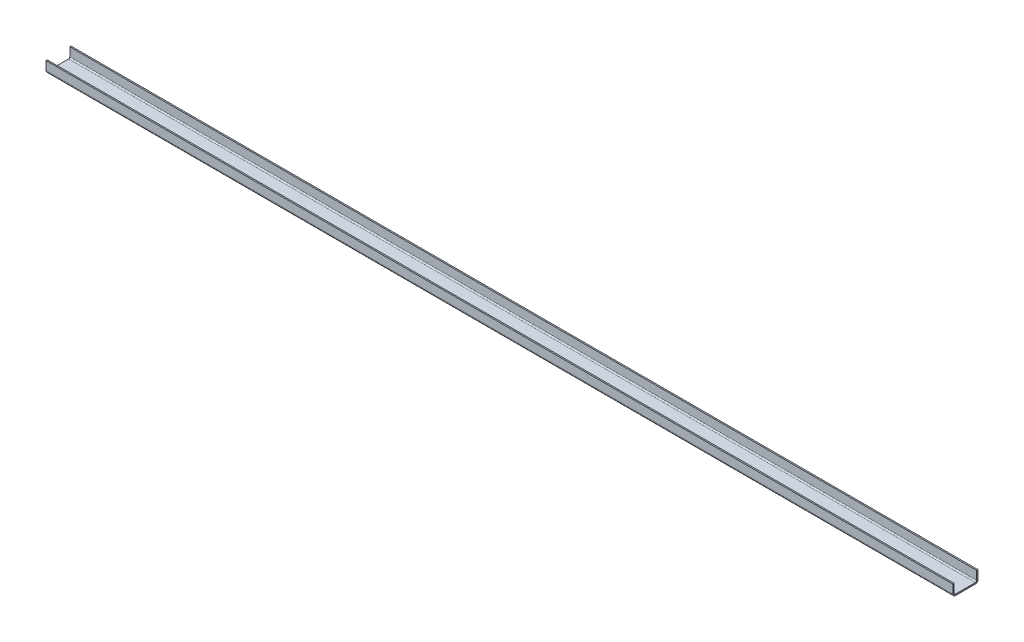
ISO-10303-21;
HEADER;
FILE_DESCRIPTION(('STEP AP214'),'2;1');
FILE_NAME('part.step','',(''),(''),'','','');
FILE_SCHEMA(('AUTOMOTIVE_DESIGN { 1 0 10303 214 1 1 1 1 }'));
ENDSEC;
DATA;
#1=APPLICATION_CONTEXT('core data for automotive mechanical design processes');
#2=APPLICATION_PROTOCOL_DEFINITION('international standard','automotive_design',2000,#1);
#3=PRODUCT_CONTEXT('',#1,'mechanical');
#4=PRODUCT('Part','Part','',(#3));
#5=PRODUCT_RELATED_PRODUCT_CATEGORY('part','',(#4));
#6=PRODUCT_DEFINITION_FORMATION('','',#4);
#7=PRODUCT_DEFINITION_CONTEXT('part definition',#1,'design');
#8=PRODUCT_DEFINITION('design','',#6,#7);
#9=PRODUCT_DEFINITION_SHAPE('','',#8);
#10=(LENGTH_UNIT() NAMED_UNIT(*) SI_UNIT(.MILLI.,.METRE.));
#11=(NAMED_UNIT(*) PLANE_ANGLE_UNIT() SI_UNIT($,.RADIAN.));
#12=(NAMED_UNIT(*) SI_UNIT($,.STERADIAN.) SOLID_ANGLE_UNIT());
#13=UNCERTAINTY_MEASURE_WITH_UNIT(LENGTH_MEASURE(1.E-05),#10,'distance_accuracy_value','');
#14=(GEOMETRIC_REPRESENTATION_CONTEXT(3) GLOBAL_UNCERTAINTY_ASSIGNED_CONTEXT((#13)) GLOBAL_UNIT_ASSIGNED_CONTEXT((#10,
#11,#12)) REPRESENTATION_CONTEXT('',''));
#15=CARTESIAN_POINT('',(0.,0.,0.));
#16=DIRECTION('',(0.,0.,1.));
#17=DIRECTION('',(1.,0.,0.));
#18=AXIS2_PLACEMENT_3D('',#15,#16,#17);
#19=CARTESIAN_POINT('',(0.,4.123385067,0.));
#20=DIRECTION('',(0.,1.,0.));
#21=DIRECTION('',(0.,0.,1.));
#22=AXIS2_PLACEMENT_3D('',#19,#20,#21);
#23=PLANE('',#22);
#24=DIRECTION('',(0.,0.,1.));
#25=VECTOR('',#24,1.);
#26=CARTESIAN_POINT('',(1057.5,4.123385067,0.));
#27=LINE('',#26,#25);
#28=CARTESIAN_POINT('',(1057.5,4.123385067,-26.248385067));
#29=VERTEX_POINT('',#28);
#30=CARTESIAN_POINT('',(1057.5,4.123385067,-27.248385067));
#31=VERTEX_POINT('',#30);
#32=EDGE_CURVE('E200',#29,#31,#27,.F.);
#33=ORIENTED_EDGE('',*,*,#32,.T.);
#34=DIRECTION('',(1.,0.,0.));
#35=VECTOR('',#34,1.);
#36=CARTESIAN_POINT('',(0.,4.123385067,-27.248385067));
#37=LINE('',#36,#35);
#38=CARTESIAN_POINT('',(352.5,4.123385067,-27.248385067));
#39=VERTEX_POINT('',#38);
#40=EDGE_CURVE('E182',#39,#31,#37,.T.);
#41=ORIENTED_EDGE('',*,*,#40,.F.);
#42=DIRECTION('',(0.,0.,1.));
#43=VECTOR('',#42,1.);
#44=CARTESIAN_POINT('',(352.5,4.123385067,0.));
#45=LINE('',#44,#43);
#46=CARTESIAN_POINT('',(352.5,4.123385067,-26.248385067));
#47=VERTEX_POINT('',#46);
#48=EDGE_CURVE('E203',#39,#47,#45,.T.);
#49=ORIENTED_EDGE('',*,*,#48,.T.);
#50=DIRECTION('',(1.,0.,0.));
#51=VECTOR('',#50,1.);
#52=CARTESIAN_POINT('',(0.,4.123385067,-26.248385067));
#53=LINE('',#52,#51);
#54=EDGE_CURVE('E110',#29,#47,#53,.F.);
#55=ORIENTED_EDGE('',*,*,#54,.F.);
#56=EDGE_LOOP('',(#33,#41,#49,#55));
#57=FACE_BOUND('',#56,.T.);
#58=ADVANCED_FACE('F17',(#57),#23,.T.);
#59=CARTESIAN_POINT('',(352.5,-2.58,-25.248385067));
#60=DIRECTION('',(-1.,0.,0.));
#61=DIRECTION('',(0.,0.,1.));
#62=AXIS2_PLACEMENT_3D('',#59,#60,#61);
#63=CYLINDRICAL_SURFACE('',#62,1.000000000063);
#64=CARTESIAN_POINT('',(1057.5,-2.58,-25.248385067));
#65=DIRECTION('',(-1.,0.,0.));
#66=DIRECTION('',(0.,0.,1.));
#67=AXIS2_PLACEMENT_3D('',#64,#65,#66);
#68=CIRCLE('',#67,1.000000000063);
#69=CARTESIAN_POINT('',(1057.5,-3.58,-25.248385067));
#70=VERTEX_POINT('',#69);
#71=CARTESIAN_POINT('',(1057.5,-2.58,-26.248385067));
#72=VERTEX_POINT('',#71);
#73=EDGE_CURVE('E114',#70,#72,#68,.F.);
#74=ORIENTED_EDGE('',*,*,#73,.T.);
#75=DIRECTION('',(1.,0.,0.));
#76=VECTOR('',#75,1.);
#77=CARTESIAN_POINT('',(0.,-2.58,-26.248385067));
#78=LINE('',#77,#76);
#79=CARTESIAN_POINT('',(352.5,-2.58,-26.248385067));
#80=VERTEX_POINT('',#79);
#81=EDGE_CURVE('E179',#80,#72,#78,.T.);
#82=ORIENTED_EDGE('',*,*,#81,.F.);
#83=CARTESIAN_POINT('',(352.5,-2.58,-25.248385067));
#84=DIRECTION('',(-1.,0.,0.));
#85=DIRECTION('',(0.,0.,1.));
#86=AXIS2_PLACEMENT_3D('',#83,#84,#85);
#87=CIRCLE('',#86,1.000000000063);
#88=CARTESIAN_POINT('',(352.5,-3.58,-25.248385067));
#89=VERTEX_POINT('',#88);
#90=EDGE_CURVE('E20',#80,#89,#87,.T.);
#91=ORIENTED_EDGE('',*,*,#90,.T.);
#92=DIRECTION('',(1.,0.,0.));
#93=VECTOR('',#92,1.);
#94=CARTESIAN_POINT('',(0.,-3.58,-25.248385067));
#95=LINE('',#94,#93);
#96=EDGE_CURVE('E109',#70,#89,#95,.F.);
#97=ORIENTED_EDGE('',*,*,#96,.F.);
#98=EDGE_LOOP('',(#74,#82,#91,#97));
#99=FACE_BOUND('',#98,.T.);
#100=ADVANCED_FACE('F221',(#99),#63,.F.);
#101=CARTESIAN_POINT('',(352.5,-2.58,-9.751614933));
#102=DIRECTION('',(-1.,0.,0.));
#103=DIRECTION('',(0.,0.,1.));
#104=AXIS2_PLACEMENT_3D('',#101,#102,#103);
#105=CYLINDRICAL_SURFACE('',#104,1.);
#106=CARTESIAN_POINT('',(1057.5,-2.58,-9.751614933));
#107=DIRECTION('',(-1.,0.,0.));
#108=DIRECTION('',(0.,0.,1.));
#109=AXIS2_PLACEMENT_3D('',#106,#107,#108);
#110=CIRCLE('',#109,1.);
#111=CARTESIAN_POINT('',(1057.5,-2.58,-8.75161493302429));
#112=VERTEX_POINT('',#111);
#113=CARTESIAN_POINT('',(1057.5,-3.58,-9.751614933));
#114=VERTEX_POINT('',#113);
#115=EDGE_CURVE('E89',#112,#114,#110,.F.);
#116=ORIENTED_EDGE('',*,*,#115,.T.);
#117=DIRECTION('',(1.,0.,0.));
#118=VECTOR('',#117,1.);
#119=CARTESIAN_POINT('',(0.,-3.58,-9.751614933));
#120=LINE('',#119,#118);
#121=CARTESIAN_POINT('',(352.5,-3.58,-9.751614933));
#122=VERTEX_POINT('',#121);
#123=EDGE_CURVE('E92',#122,#114,#120,.T.);
#124=ORIENTED_EDGE('',*,*,#123,.F.);
#125=CARTESIAN_POINT('',(352.5,-2.58,-9.751614933));
#126=DIRECTION('',(-1.,0.,0.));
#127=DIRECTION('',(0.,0.,1.));
#128=AXIS2_PLACEMENT_3D('',#125,#126,#127);
#129=CIRCLE('',#128,1.);
#130=CARTESIAN_POINT('',(352.5,-2.58,-8.75161493302429));
#131=VERTEX_POINT('',#130);
#132=EDGE_CURVE('E100',#122,#131,#129,.T.);
#133=ORIENTED_EDGE('',*,*,#132,.T.);
#134=DIRECTION('',(1.,0.,0.));
#135=VECTOR('',#134,1.);
#136=CARTESIAN_POINT('',(0.,-2.58,-8.75161493304859));
#137=LINE('',#136,#135);
#138=EDGE_CURVE('E95',#112,#131,#137,.F.);
#139=ORIENTED_EDGE('',*,*,#138,.F.);
#140=EDGE_LOOP('',(#116,#124,#133,#139));
#141=FACE_BOUND('',#140,.T.);
#142=ADVANCED_FACE('F91',(#141),#105,.F.);
#143=CARTESIAN_POINT('',(0.,4.123385067,0.));
#144=DIRECTION('',(0.,1.,0.));
#145=DIRECTION('',(0.,0.,1.));
#146=AXIS2_PLACEMENT_3D('',#143,#144,#145);
#147=PLANE('',#146);
#148=DIRECTION('',(0.,0.,1.));
#149=VECTOR('',#148,1.);
#150=CARTESIAN_POINT('',(1057.5,4.123385067,0.));
#151=LINE('',#150,#149);
#152=CARTESIAN_POINT('',(1057.5,4.123385067,-7.751614933));
#153=VERTEX_POINT('',#152);
#154=CARTESIAN_POINT('',(1057.5,4.123385067,-8.75161493297412));
#155=VERTEX_POINT('',#154);
#156=EDGE_CURVE('E189',#153,#155,#151,.F.);
#157=ORIENTED_EDGE('',*,*,#156,.T.);
#158=DIRECTION('',(1.,0.,0.));
#159=VECTOR('',#158,1.);
#160=CARTESIAN_POINT('',(0.,4.123385067,-8.75161493292235));
#161=LINE('',#160,#159);
#162=CARTESIAN_POINT('',(352.5,4.123385067,-8.75161493297412));
#163=VERTEX_POINT('',#162);
#164=EDGE_CURVE('E173',#163,#155,#161,.T.);
#165=ORIENTED_EDGE('',*,*,#164,.F.);
#166=DIRECTION('',(0.,0.,1.));
#167=VECTOR('',#166,1.);
#168=CARTESIAN_POINT('',(352.5,4.123385067,0.));
#169=LINE('',#168,#167);
#170=CARTESIAN_POINT('',(352.5,4.123385067,-7.751614933));
#171=VERTEX_POINT('',#170);
#172=EDGE_CURVE('E99',#163,#171,#169,.T.);
#173=ORIENTED_EDGE('',*,*,#172,.T.);
#174=DIRECTION('',(1.,0.,0.));
#175=VECTOR('',#174,1.);
#176=CARTESIAN_POINT('',(0.,4.123385067,-7.75161493300001));
#177=LINE('',#176,#175);
#178=EDGE_CURVE('E167',#153,#171,#177,.F.);
#179=ORIENTED_EDGE('',*,*,#178,.F.);
#180=EDGE_LOOP('',(#157,#165,#173,#179));
#181=FACE_BOUND('',#180,.T.);
#182=ADVANCED_FACE('F264',(#181),#147,.T.);
#183=CARTESIAN_POINT('',(0.,0.,-27.248385067));
#184=DIRECTION('',(0.,0.,-1.));
#185=DIRECTION('',(0.,1.,0.));
#186=AXIS2_PLACEMENT_3D('',#183,#184,#185);
#187=PLANE('',#186);
#188=DIRECTION('',(0.,1.,0.));
#189=VECTOR('',#188,1.);
#190=CARTESIAN_POINT('',(1057.5,0.,-27.248385067));
#191=LINE('',#190,#189);
#192=CARTESIAN_POINT('',(1057.5,-2.58,-27.248385067));
#193=VERTEX_POINT('',#192);
#194=EDGE_CURVE('E121',#193,#31,#191,.T.);
#195=ORIENTED_EDGE('',*,*,#194,.F.);
#196=DIRECTION('',(1.,0.,0.));
#197=VECTOR('',#196,1.);
#198=CARTESIAN_POINT('',(352.5,-2.58,-27.248385067));
#199=LINE('',#198,#197);
#200=CARTESIAN_POINT('',(352.5,-2.58,-27.248385067));
#201=VERTEX_POINT('',#200);
#202=EDGE_CURVE('E130',#201,#193,#199,.T.);
#203=ORIENTED_EDGE('',*,*,#202,.F.);
#204=DIRECTION('',(0.,1.,0.));
#205=VECTOR('',#204,1.);
#206=CARTESIAN_POINT('',(352.5,0.,-27.248385067));
#207=LINE('',#206,#205);
#208=EDGE_CURVE('E156',#39,#201,#207,.F.);
#209=ORIENTED_EDGE('',*,*,#208,.F.);
#210=ORIENTED_EDGE('',*,*,#40,.T.);
#211=EDGE_LOOP('',(#195,#203,#209,#210));
#212=FACE_BOUND('',#211,.T.);
#213=ADVANCED_FACE('F250',(#212),#187,.T.);
#214=CARTESIAN_POINT('',(0.,0.,-26.248385067));
#215=DIRECTION('',(0.,0.,1.));
#216=DIRECTION('',(0.,-1.,0.));
#217=AXIS2_PLACEMENT_3D('',#214,#215,#216);
#218=PLANE('',#217);
#219=DIRECTION('',(0.,1.,0.));
#220=VECTOR('',#219,1.);
#221=CARTESIAN_POINT('',(1057.5,0.,-26.248385067));
#222=LINE('',#221,#220);
#223=EDGE_CURVE('E117',#29,#72,#222,.F.);
#224=ORIENTED_EDGE('',*,*,#223,.F.);
#225=ORIENTED_EDGE('',*,*,#54,.T.);
#226=DIRECTION('',(0.,1.,0.));
#227=VECTOR('',#226,1.);
#228=CARTESIAN_POINT('',(352.5,0.,-26.248385067));
#229=LINE('',#228,#227);
#230=EDGE_CURVE('E141',#80,#47,#229,.T.);
#231=ORIENTED_EDGE('',*,*,#230,.F.);
#232=ORIENTED_EDGE('',*,*,#81,.T.);
#233=EDGE_LOOP('',(#224,#225,#231,#232));
#234=FACE_BOUND('',#233,.T.);
#235=ADVANCED_FACE('F248',(#234),#218,.T.);
#236=CARTESIAN_POINT('',(0.,-3.58,0.));
#237=DIRECTION('',(0.,1.,0.));
#238=DIRECTION('',(0.,0.,1.));
#239=AXIS2_PLACEMENT_3D('',#236,#237,#238);
#240=PLANE('',#239);
#241=DIRECTION('',(0.,0.,-1.));
#242=VECTOR('',#241,1.);
#243=CARTESIAN_POINT('',(1057.5,-3.58,0.));
#244=LINE('',#243,#242);
#245=EDGE_CURVE('E106',#70,#114,#244,.F.);
#246=ORIENTED_EDGE('',*,*,#245,.F.);
#247=ORIENTED_EDGE('',*,*,#96,.T.);
#248=DIRECTION('',(0.,0.,1.));
#249=VECTOR('',#248,1.);
#250=CARTESIAN_POINT('',(352.5,-3.58,0.));
#251=LINE('',#250,#249);
#252=EDGE_CURVE('E108',#122,#89,#251,.F.);
#253=ORIENTED_EDGE('',*,*,#252,.F.);
#254=ORIENTED_EDGE('',*,*,#123,.T.);
#255=EDGE_LOOP('',(#246,#247,#253,#254));
#256=FACE_BOUND('',#255,.T.);
#257=ADVANCED_FACE('F104',(#256),#240,.T.);
#258=CARTESIAN_POINT('',(0.,0.,-8.751614933));
#259=DIRECTION('',(0.,1.8832E-11,-1.));
#260=DIRECTION('',(0.,1.,1.8832E-11));
#261=AXIS2_PLACEMENT_3D('',#258,#259,#260);
#262=PLANE('',#261);
#263=DIRECTION('',(0.,1.,0.));
#264=VECTOR('',#263,1.);
#265=CARTESIAN_POINT('',(1057.5,0.,-8.751614933));
#266=LINE('',#265,#264);
#267=EDGE_CURVE('E116',#112,#155,#266,.T.);
#268=ORIENTED_EDGE('',*,*,#267,.F.);
#269=ORIENTED_EDGE('',*,*,#138,.T.);
#270=DIRECTION('',(0.,1.,0.));
#271=VECTOR('',#270,1.);
#272=CARTESIAN_POINT('',(352.5,0.,-8.751614933));
#273=LINE('',#272,#271);
#274=EDGE_CURVE('E148',#163,#131,#273,.F.);
#275=ORIENTED_EDGE('',*,*,#274,.F.);
#276=ORIENTED_EDGE('',*,*,#164,.T.);
#277=EDGE_LOOP('',(#268,#269,#275,#276));
#278=FACE_BOUND('',#277,.T.);
#279=ADVANCED_FACE('F229',(#278),#262,.T.);
#280=CARTESIAN_POINT('',(0.,0.,-7.751614933));
#281=DIRECTION('',(0.,0.,1.));
#282=DIRECTION('',(0.,-1.,0.));
#283=AXIS2_PLACEMENT_3D('',#280,#281,#282);
#284=PLANE('',#283);
#285=DIRECTION('',(0.,1.,0.));
#286=VECTOR('',#285,1.);
#287=CARTESIAN_POINT('',(1057.5,0.,-7.751614933));
#288=LINE('',#287,#286);
#289=CARTESIAN_POINT('',(1057.5,-2.5799999995,-7.7516149329685));
#290=VERTEX_POINT('',#289);
#291=EDGE_CURVE('E119',#153,#290,#288,.F.);
#292=ORIENTED_EDGE('',*,*,#291,.F.);
#293=ORIENTED_EDGE('',*,*,#178,.T.);
#294=DIRECTION('',(0.,1.,0.));
#295=VECTOR('',#294,1.);
#296=CARTESIAN_POINT('',(352.5,0.,-7.751614933));
#297=LINE('',#296,#295);
#298=CARTESIAN_POINT('',(352.5,-2.5799999995,-7.7516149329685));
#299=VERTEX_POINT('',#298);
#300=EDGE_CURVE('E151',#299,#171,#297,.T.);
#301=ORIENTED_EDGE('',*,*,#300,.F.);
#302=DIRECTION('',(1.,0.,0.));
#303=VECTOR('',#302,1.);
#304=CARTESIAN_POINT('',(352.5,-2.58,-7.751614932937));
#305=LINE('',#304,#303);
#306=EDGE_CURVE('E160',#290,#299,#305,.F.);
#307=ORIENTED_EDGE('',*,*,#306,.F.);
#308=EDGE_LOOP('',(#292,#293,#301,#307));
#309=FACE_BOUND('',#308,.T.);
#310=ADVANCED_FACE('F263',(#309),#284,.T.);
#311=CARTESIAN_POINT('',(352.5,0.,0.));
#312=DIRECTION('',(-1.,0.,0.));
#313=DIRECTION('',(0.,0.,1.));
#314=AXIS2_PLACEMENT_3D('',#311,#312,#313);
#315=PLANE('',#314);
#316=ORIENTED_EDGE('',*,*,#230,.T.);
#317=ORIENTED_EDGE('',*,*,#48,.F.);
#318=ORIENTED_EDGE('',*,*,#208,.T.);
#319=CARTESIAN_POINT('',(352.5,-2.58,-25.248385067));
#320=DIRECTION('',(1.,0.,0.));
#321=DIRECTION('',(0.,0.,-1.));
#322=AXIS2_PLACEMENT_3D('',#319,#320,#321);
#323=CIRCLE('',#322,2.);
#324=CARTESIAN_POINT('',(352.5,-4.58,-25.248385067));
#325=VERTEX_POINT('',#324);
#326=EDGE_CURVE('E144',#325,#201,#323,.T.);
#327=ORIENTED_EDGE('',*,*,#326,.F.);
#328=DIRECTION('',(0.,0.,-1.));
#329=VECTOR('',#328,1.);
#330=CARTESIAN_POINT('',(352.5,-4.58,0.));
#331=LINE('',#330,#329);
#332=CARTESIAN_POINT('',(352.5,-4.58,-9.7516149335));
#333=VERTEX_POINT('',#332);
#334=EDGE_CURVE('E136',#333,#325,#331,.T.);
#335=ORIENTED_EDGE('',*,*,#334,.F.);
#336=CARTESIAN_POINT('',(352.5,-2.58,-9.751614934));
#337=DIRECTION('',(1.,0.,0.));
#338=DIRECTION('',(0.,0.,-1.));
#339=AXIS2_PLACEMENT_3D('',#336,#337,#338);
#340=CIRCLE('',#339,2.);
#341=EDGE_CURVE('E211',#299,#333,#340,.T.);
#342=ORIENTED_EDGE('',*,*,#341,.F.);
#343=ORIENTED_EDGE('',*,*,#300,.T.);
#344=ORIENTED_EDGE('',*,*,#172,.F.);
#345=ORIENTED_EDGE('',*,*,#274,.T.);
#346=ORIENTED_EDGE('',*,*,#132,.F.);
#347=ORIENTED_EDGE('',*,*,#252,.T.);
#348=ORIENTED_EDGE('',*,*,#90,.F.);
#349=EDGE_LOOP('',(#316,#317,#318,#327,#335,#342,#343,#344,#345,#346,#347,#348));
#350=FACE_BOUND('',#349,.T.);
#351=ADVANCED_FACE('F225',(#350),#315,.T.);
#352=CARTESIAN_POINT('',(352.5,-2.58,-25.248385067));
#353=DIRECTION('',(1.,0.,0.));
#354=DIRECTION('',(0.,0.,-1.));
#355=AXIS2_PLACEMENT_3D('',#352,#353,#354);
#356=CYLINDRICAL_SURFACE('',#355,2.);
#357=CARTESIAN_POINT('',(1057.5,-2.58,-25.248385067));
#358=DIRECTION('',(1.,0.,0.));
#359=DIRECTION('',(0.,0.,-1.));
#360=AXIS2_PLACEMENT_3D('',#357,#358,#359);
#361=CIRCLE('',#360,2.);
#362=CARTESIAN_POINT('',(1057.5,-4.58,-25.248385067));
#363=VERTEX_POINT('',#362);
#364=EDGE_CURVE('E214',#363,#193,#361,.T.);
#365=ORIENTED_EDGE('',*,*,#364,.F.);
#366=DIRECTION('',(1.,0.,0.));
#367=VECTOR('',#366,1.);
#368=CARTESIAN_POINT('',(0.,-4.58,-25.248385067));
#369=LINE('',#368,#367);
#370=EDGE_CURVE('E133',#325,#363,#369,.T.);
#371=ORIENTED_EDGE('',*,*,#370,.F.);
#372=ORIENTED_EDGE('',*,*,#326,.T.);
#373=ORIENTED_EDGE('',*,*,#202,.T.);
#374=EDGE_LOOP('',(#365,#371,#372,#373));
#375=FACE_BOUND('',#374,.T.);
#376=ADVANCED_FACE('F254',(#375),#356,.T.);
#377=CARTESIAN_POINT('',(1057.5,0.,0.));
#378=DIRECTION('',(1.,0.,0.));
#379=DIRECTION('',(0.,0.,-1.));
#380=AXIS2_PLACEMENT_3D('',#377,#378,#379);
#381=PLANE('',#380);
#382=DIRECTION('',(0.,0.,-1.));
#383=VECTOR('',#382,1.);
#384=CARTESIAN_POINT('',(1057.5,-4.58,0.));
#385=LINE('',#384,#383);
#386=CARTESIAN_POINT('',(1057.5,-4.58,-9.7516149335));
#387=VERTEX_POINT('',#386);
#388=EDGE_CURVE('E26',#363,#387,#385,.F.);
#389=ORIENTED_EDGE('',*,*,#388,.F.);
#390=ORIENTED_EDGE('',*,*,#364,.T.);
#391=ORIENTED_EDGE('',*,*,#194,.T.);
#392=ORIENTED_EDGE('',*,*,#32,.F.);
#393=ORIENTED_EDGE('',*,*,#223,.T.);
#394=ORIENTED_EDGE('',*,*,#73,.F.);
#395=ORIENTED_EDGE('',*,*,#245,.T.);
#396=ORIENTED_EDGE('',*,*,#115,.F.);
#397=ORIENTED_EDGE('',*,*,#267,.T.);
#398=ORIENTED_EDGE('',*,*,#156,.F.);
#399=ORIENTED_EDGE('',*,*,#291,.T.);
#400=CARTESIAN_POINT('',(1057.5,-2.58,-9.751614934));
#401=DIRECTION('',(1.,0.,0.));
#402=DIRECTION('',(0.,0.,-1.));
#403=AXIS2_PLACEMENT_3D('',#400,#401,#402);
#404=CIRCLE('',#403,2.);
#405=EDGE_CURVE('E35',#387,#290,#404,.F.);
#406=ORIENTED_EDGE('',*,*,#405,.F.);
#407=EDGE_LOOP('',(#389,#390,#391,#392,#393,#394,#395,#396,#397,#398,#399,#406));
#408=FACE_BOUND('',#407,.T.);
#409=ADVANCED_FACE('F112',(#408),#381,.T.);
#410=CARTESIAN_POINT('',(352.5,-2.58,-9.751614934));
#411=DIRECTION('',(1.,0.,0.));
#412=DIRECTION('',(0.,0.,-1.));
#413=AXIS2_PLACEMENT_3D('',#410,#411,#412);
#414=CYLINDRICAL_SURFACE('',#413,2.);
#415=ORIENTED_EDGE('',*,*,#405,.T.);
#416=ORIENTED_EDGE('',*,*,#306,.T.);
#417=ORIENTED_EDGE('',*,*,#341,.T.);
#418=DIRECTION('',(1.,0.,0.));
#419=VECTOR('',#418,1.);
#420=CARTESIAN_POINT('',(0.,-4.58,-9.751614933));
#421=LINE('',#420,#419);
#422=EDGE_CURVE('E11',#387,#333,#421,.F.);
#423=ORIENTED_EDGE('',*,*,#422,.F.);
#424=EDGE_LOOP('',(#415,#416,#417,#423));
#425=FACE_BOUND('',#424,.T.);
#426=ADVANCED_FACE('F258',(#425),#414,.T.);
#427=CARTESIAN_POINT('',(0.,-4.58,0.));
#428=DIRECTION('',(0.,-1.,0.));
#429=DIRECTION('',(0.,0.,-1.));
#430=AXIS2_PLACEMENT_3D('',#427,#428,#429);
#431=PLANE('',#430);
#432=ORIENTED_EDGE('',*,*,#388,.T.);
#433=ORIENTED_EDGE('',*,*,#422,.T.);
#434=ORIENTED_EDGE('',*,*,#334,.T.);
#435=ORIENTED_EDGE('',*,*,#370,.T.);
#436=EDGE_LOOP('',(#432,#433,#434,#435));
#437=FACE_BOUND('',#436,.T.);
#438=ADVANCED_FACE('F256',(#437),#431,.T.);
#439=CLOSED_SHELL('',(#58,#100,#142,#182,#213,#235,#257,#279,#310,#351,#376,#409,#426,#438));
#440=MANIFOLD_SOLID_BREP('B1',#439);
#441=ADVANCED_BREP_SHAPE_REPRESENTATION('',(#18,#440),#14);
#442=SHAPE_DEFINITION_REPRESENTATION(#9,#441);
ENDSEC;
END-ISO-10303-21;
